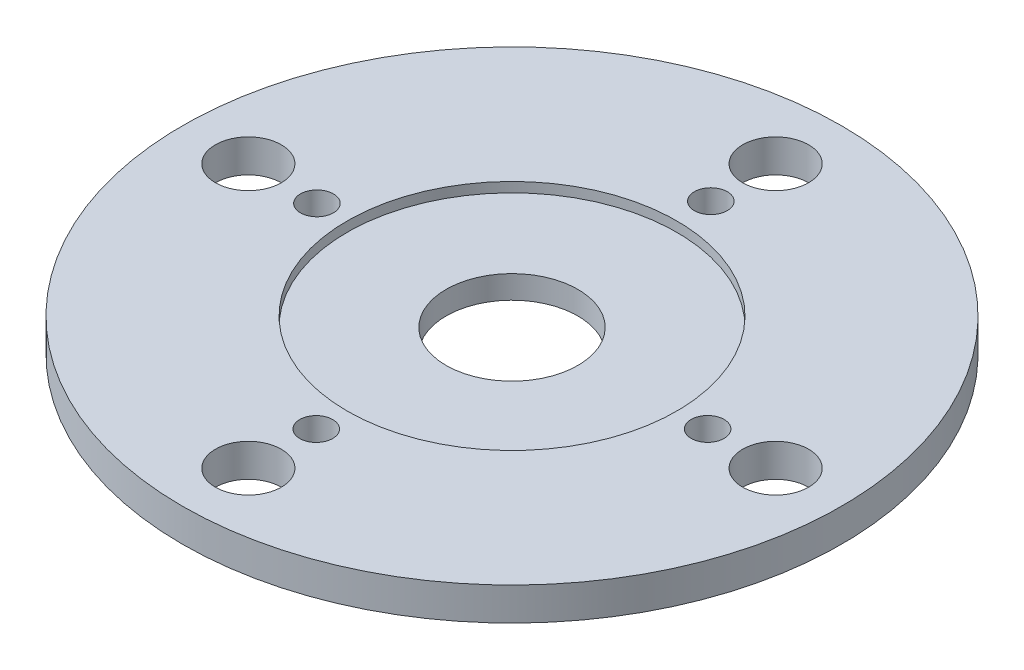
ISO-10303-21;
HEADER;
FILE_DESCRIPTION(('STEP AP214'),'2;1');
FILE_NAME('part.step','',(''),(''),'','','');
FILE_SCHEMA(('AUTOMOTIVE_DESIGN { 1 0 10303 214 1 1 1 1 }'));
ENDSEC;
DATA;
#1=APPLICATION_CONTEXT('core data for automotive mechanical design processes');
#2=APPLICATION_PROTOCOL_DEFINITION('international standard','automotive_design',2000,#1);
#3=PRODUCT_CONTEXT('',#1,'mechanical');
#4=PRODUCT('Part','Part','',(#3));
#5=PRODUCT_RELATED_PRODUCT_CATEGORY('part','',(#4));
#6=PRODUCT_DEFINITION_FORMATION('','',#4);
#7=PRODUCT_DEFINITION_CONTEXT('part definition',#1,'design');
#8=PRODUCT_DEFINITION('design','',#6,#7);
#9=PRODUCT_DEFINITION_SHAPE('','',#8);
#10=(LENGTH_UNIT() NAMED_UNIT(*) SI_UNIT(.MILLI.,.METRE.));
#11=(NAMED_UNIT(*) PLANE_ANGLE_UNIT() SI_UNIT($,.RADIAN.));
#12=(NAMED_UNIT(*) SI_UNIT($,.STERADIAN.) SOLID_ANGLE_UNIT());
#13=UNCERTAINTY_MEASURE_WITH_UNIT(LENGTH_MEASURE(1.E-05),#10,'distance_accuracy_value','');
#14=(GEOMETRIC_REPRESENTATION_CONTEXT(3) GLOBAL_UNCERTAINTY_ASSIGNED_CONTEXT((#13)) GLOBAL_UNIT_ASSIGNED_CONTEXT((#10,
#11,#12)) REPRESENTATION_CONTEXT('',''));
#15=CARTESIAN_POINT('',(0.,0.,0.));
#16=DIRECTION('',(0.,0.,1.));
#17=DIRECTION('',(1.,0.,0.));
#18=AXIS2_PLACEMENT_3D('',#15,#16,#17);
#19=CARTESIAN_POINT('',(0.,1.,0.));
#20=DIRECTION('',(0.,-1.,0.));
#21=DIRECTION('',(0.,0.,-1.));
#22=AXIS2_PLACEMENT_3D('',#19,#20,#21);
#23=CYLINDRICAL_SURFACE('',#22,2.);
#24=CARTESIAN_POINT('',(0.,0.,0.));
#25=DIRECTION('',(0.,1.,0.));
#26=DIRECTION('',(0.,0.,1.));
#27=AXIS2_PLACEMENT_3D('',#24,#25,#26);
#28=CIRCLE('',#27,2.);
#29=CARTESIAN_POINT('',(0.,0.,2.));
#30=VERTEX_POINT('',#29);
#31=EDGE_CURVE('E44',#30,#30,#28,.T.);
#32=ORIENTED_EDGE('',*,*,#31,.F.);
#33=EDGE_LOOP('',(#32));
#34=FACE_BOUND('',#33,.T.);
#35=CARTESIAN_POINT('',(0.,0.7,0.));
#36=DIRECTION('',(0.,1.,0.));
#37=DIRECTION('',(0.,0.,1.));
#38=AXIS2_PLACEMENT_3D('',#35,#36,#37);
#39=CIRCLE('',#38,2.);
#40=CARTESIAN_POINT('',(0.,0.7,2.));
#41=VERTEX_POINT('',#40);
#42=EDGE_CURVE('E35',#41,#41,#39,.T.);
#43=ORIENTED_EDGE('',*,*,#42,.T.);
#44=EDGE_LOOP('',(#43));
#45=FACE_BOUND('',#44,.T.);
#46=ADVANCED_FACE('F31',(#34,#45),#23,.F.);
#47=CARTESIAN_POINT('',(0.,1.,0.));
#48=DIRECTION('',(0.,1.,0.));
#49=DIRECTION('',(0.,0.,1.));
#50=AXIS2_PLACEMENT_3D('',#47,#48,#49);
#51=PLANE('',#50);
#52=CARTESIAN_POINT('',(0.,1.,0.));
#53=DIRECTION('',(0.,1.,0.));
#54=DIRECTION('',(0.,0.,1.));
#55=AXIS2_PLACEMENT_3D('',#52,#53,#54);
#56=CIRCLE('',#55,5.);
#57=CARTESIAN_POINT('',(0.,1.,5.));
#58=VERTEX_POINT('',#57);
#59=EDGE_CURVE('E96',#58,#58,#56,.T.);
#60=ORIENTED_EDGE('',*,*,#59,.F.);
#61=EDGE_LOOP('',(#60));
#62=FACE_BOUND('',#61,.T.);
#63=CARTESIAN_POINT('',(-2.8421709430404E-11,1.,-6.03335240026581));
#64=DIRECTION('',(0.,1.,0.));
#65=DIRECTION('',(0.,0.,1.));
#66=AXIS2_PLACEMENT_3D('',#63,#64,#65);
#67=CIRCLE('',#66,0.499999999999999);
#68=CARTESIAN_POINT('',(-2.8421709430404E-11,1.,-5.53335240026581));
#69=VERTEX_POINT('',#68);
#70=EDGE_CURVE('E82',#69,#69,#67,.T.);
#71=ORIENTED_EDGE('',*,*,#70,.F.);
#72=EDGE_LOOP('',(#71));
#73=FACE_BOUND('',#72,.T.);
#74=CARTESIAN_POINT('',(5.93682324591782,1.,-2.8421709430404E-11));
#75=DIRECTION('',(0.,1.,0.));
#76=DIRECTION('',(0.,0.,-1.));
#77=AXIS2_PLACEMENT_3D('',#74,#75,#76);
#78=CIRCLE('',#77,0.5);
#79=CARTESIAN_POINT('',(5.93682324591782,1.,-0.500000000028421));
#80=VERTEX_POINT('',#79);
#81=EDGE_CURVE('E70',#80,#80,#78,.T.);
#82=ORIENTED_EDGE('',*,*,#81,.F.);
#83=EDGE_LOOP('',(#82));
#84=FACE_BOUND('',#83,.T.);
#85=CARTESIAN_POINT('',(0.,1.,5.94141571224327));
#86=DIRECTION('',(0.,1.,0.));
#87=DIRECTION('',(0.,0.,-1.));
#88=AXIS2_PLACEMENT_3D('',#85,#86,#87);
#89=CIRCLE('',#88,0.500000000000001);
#90=CARTESIAN_POINT('',(0.,1.,5.44141571224327));
#91=VERTEX_POINT('',#90);
#92=EDGE_CURVE('E58',#91,#91,#89,.T.);
#93=ORIENTED_EDGE('',*,*,#92,.F.);
#94=EDGE_LOOP('',(#93));
#95=FACE_BOUND('',#94,.T.);
#96=CARTESIAN_POINT('',(-8.,1.,0.));
#97=DIRECTION('',(0.,1.,0.));
#98=DIRECTION('',(0.,0.,1.));
#99=AXIS2_PLACEMENT_3D('',#96,#97,#98);
#100=CIRCLE('',#99,1.);
#101=CARTESIAN_POINT('',(-8.,1.,1.));
#102=VERTEX_POINT('',#101);
#103=EDGE_CURVE('E48',#102,#102,#100,.T.);
#104=ORIENTED_EDGE('',*,*,#103,.F.);
#105=EDGE_LOOP('',(#104));
#106=FACE_BOUND('',#105,.T.);
#107=CARTESIAN_POINT('',(0.,1.,0.));
#108=DIRECTION('',(0.,1.,0.));
#109=DIRECTION('',(0.,0.,1.));
#110=AXIS2_PLACEMENT_3D('',#107,#108,#109);
#111=CIRCLE('',#110,10.);
#112=CARTESIAN_POINT('',(0.,1.,10.));
#113=VERTEX_POINT('',#112);
#114=EDGE_CURVE('E10',#113,#113,#111,.T.);
#115=ORIENTED_EDGE('',*,*,#114,.T.);
#116=EDGE_LOOP('',(#115));
#117=FACE_BOUND('',#116,.T.);
#118=CARTESIAN_POINT('',(-5.91917261272101,1.,0.));
#119=DIRECTION('',(0.,1.,0.));
#120=DIRECTION('',(0.,0.,1.));
#121=AXIS2_PLACEMENT_3D('',#118,#119,#120);
#122=CIRCLE('',#121,0.5);
#123=CARTESIAN_POINT('',(-5.91917261272101,1.,0.5));
#124=VERTEX_POINT('',#123);
#125=EDGE_CURVE('E52',#124,#124,#122,.T.);
#126=ORIENTED_EDGE('',*,*,#125,.F.);
#127=EDGE_LOOP('',(#126));
#128=FACE_BOUND('',#127,.T.);
#129=CARTESIAN_POINT('',(0.,1.,8.));
#130=DIRECTION('',(0.,1.,0.));
#131=DIRECTION('',(0.,0.,-1.));
#132=AXIS2_PLACEMENT_3D('',#129,#130,#131);
#133=CIRCLE('',#132,1.);
#134=CARTESIAN_POINT('',(0.,1.,7.));
#135=VERTEX_POINT('',#134);
#136=EDGE_CURVE('E64',#135,#135,#133,.T.);
#137=ORIENTED_EDGE('',*,*,#136,.F.);
#138=EDGE_LOOP('',(#137));
#139=FACE_BOUND('',#138,.T.);
#140=CARTESIAN_POINT('',(8.,1.,0.));
#141=DIRECTION('',(0.,1.,0.));
#142=DIRECTION('',(0.,0.,-1.));
#143=AXIS2_PLACEMENT_3D('',#140,#141,#142);
#144=CIRCLE('',#143,1.);
#145=CARTESIAN_POINT('',(8.,1.,-1.));
#146=VERTEX_POINT('',#145);
#147=EDGE_CURVE('E76',#146,#146,#144,.T.);
#148=ORIENTED_EDGE('',*,*,#147,.F.);
#149=EDGE_LOOP('',(#148));
#150=FACE_BOUND('',#149,.T.);
#151=CARTESIAN_POINT('',(0.,1.,-8.));
#152=DIRECTION('',(0.,1.,0.));
#153=DIRECTION('',(0.,0.,1.));
#154=AXIS2_PLACEMENT_3D('',#151,#152,#153);
#155=CIRCLE('',#154,1.);
#156=CARTESIAN_POINT('',(0.,1.,-7.));
#157=VERTEX_POINT('',#156);
#158=EDGE_CURVE('E88',#157,#157,#155,.T.);
#159=ORIENTED_EDGE('',*,*,#158,.F.);
#160=EDGE_LOOP('',(#159));
#161=FACE_BOUND('',#160,.T.);
#162=ADVANCED_FACE('F118',(#62,#73,#84,#95,#106,#117,#128,#139,#150,#161),#51,.T.);
#163=CARTESIAN_POINT('',(0.,0.,0.));
#164=DIRECTION('',(0.,1.,0.));
#165=DIRECTION('',(0.,0.,1.));
#166=AXIS2_PLACEMENT_3D('',#163,#164,#165);
#167=PLANE('',#166);
#168=CARTESIAN_POINT('',(0.,0.,0.));
#169=DIRECTION('',(0.,1.,0.));
#170=DIRECTION('',(0.,0.,1.));
#171=AXIS2_PLACEMENT_3D('',#168,#169,#170);
#172=CIRCLE('',#171,10.);
#173=CARTESIAN_POINT('',(0.,0.,10.));
#174=VERTEX_POINT('',#173);
#175=EDGE_CURVE('E39',#174,#174,#172,.T.);
#176=ORIENTED_EDGE('',*,*,#175,.F.);
#177=EDGE_LOOP('',(#176));
#178=FACE_BOUND('',#177,.T.);
#179=ORIENTED_EDGE('',*,*,#31,.T.);
#180=EDGE_LOOP('',(#179));
#181=FACE_BOUND('',#180,.T.);
#182=CARTESIAN_POINT('',(-8.,0.,0.));
#183=DIRECTION('',(0.,1.,0.));
#184=DIRECTION('',(0.,0.,1.));
#185=AXIS2_PLACEMENT_3D('',#182,#183,#184);
#186=CIRCLE('',#185,1.);
#187=CARTESIAN_POINT('',(-8.,0.,1.));
#188=VERTEX_POINT('',#187);
#189=EDGE_CURVE('E49',#188,#188,#186,.T.);
#190=ORIENTED_EDGE('',*,*,#189,.T.);
#191=EDGE_LOOP('',(#190));
#192=FACE_BOUND('',#191,.T.);
#193=CARTESIAN_POINT('',(-5.91917261272101,0.,0.));
#194=DIRECTION('',(0.,1.,0.));
#195=DIRECTION('',(0.,0.,1.));
#196=AXIS2_PLACEMENT_3D('',#193,#194,#195);
#197=CIRCLE('',#196,0.5);
#198=CARTESIAN_POINT('',(-5.91917261272101,0.,0.5));
#199=VERTEX_POINT('',#198);
#200=EDGE_CURVE('E55',#199,#199,#197,.T.);
#201=ORIENTED_EDGE('',*,*,#200,.T.);
#202=EDGE_LOOP('',(#201));
#203=FACE_BOUND('',#202,.T.);
#204=CARTESIAN_POINT('',(0.,0.,5.94141571224327));
#205=DIRECTION('',(0.,1.,0.));
#206=DIRECTION('',(0.,0.,-1.));
#207=AXIS2_PLACEMENT_3D('',#204,#205,#206);
#208=CIRCLE('',#207,0.500000000000001);
#209=CARTESIAN_POINT('',(0.,0.,5.44141571224327));
#210=VERTEX_POINT('',#209);
#211=EDGE_CURVE('E61',#210,#210,#208,.T.);
#212=ORIENTED_EDGE('',*,*,#211,.T.);
#213=EDGE_LOOP('',(#212));
#214=FACE_BOUND('',#213,.T.);
#215=CARTESIAN_POINT('',(0.,0.,8.));
#216=DIRECTION('',(0.,1.,0.));
#217=DIRECTION('',(0.,0.,-1.));
#218=AXIS2_PLACEMENT_3D('',#215,#216,#217);
#219=CIRCLE('',#218,1.);
#220=CARTESIAN_POINT('',(0.,0.,7.));
#221=VERTEX_POINT('',#220);
#222=EDGE_CURVE('E67',#221,#221,#219,.T.);
#223=ORIENTED_EDGE('',*,*,#222,.T.);
#224=EDGE_LOOP('',(#223));
#225=FACE_BOUND('',#224,.T.);
#226=CARTESIAN_POINT('',(5.93682324591782,0.,-2.8421709430404E-11));
#227=DIRECTION('',(0.,1.,0.));
#228=DIRECTION('',(0.,0.,-1.));
#229=AXIS2_PLACEMENT_3D('',#226,#227,#228);
#230=CIRCLE('',#229,0.5);
#231=CARTESIAN_POINT('',(5.93682324591782,0.,-0.500000000028421));
#232=VERTEX_POINT('',#231);
#233=EDGE_CURVE('E73',#232,#232,#230,.T.);
#234=ORIENTED_EDGE('',*,*,#233,.T.);
#235=EDGE_LOOP('',(#234));
#236=FACE_BOUND('',#235,.T.);
#237=CARTESIAN_POINT('',(8.,0.,0.));
#238=DIRECTION('',(0.,1.,0.));
#239=DIRECTION('',(0.,0.,-1.));
#240=AXIS2_PLACEMENT_3D('',#237,#238,#239);
#241=CIRCLE('',#240,1.);
#242=CARTESIAN_POINT('',(8.,0.,-1.));
#243=VERTEX_POINT('',#242);
#244=EDGE_CURVE('E79',#243,#243,#241,.T.);
#245=ORIENTED_EDGE('',*,*,#244,.T.);
#246=EDGE_LOOP('',(#245));
#247=FACE_BOUND('',#246,.T.);
#248=CARTESIAN_POINT('',(-2.8421709430404E-11,0.,-6.03335240026581));
#249=DIRECTION('',(0.,1.,0.));
#250=DIRECTION('',(0.,0.,1.));
#251=AXIS2_PLACEMENT_3D('',#248,#249,#250);
#252=CIRCLE('',#251,0.499999999999999);
#253=CARTESIAN_POINT('',(-2.8421709430404E-11,0.,-5.53335240026581));
#254=VERTEX_POINT('',#253);
#255=EDGE_CURVE('E85',#254,#254,#252,.T.);
#256=ORIENTED_EDGE('',*,*,#255,.T.);
#257=EDGE_LOOP('',(#256));
#258=FACE_BOUND('',#257,.T.);
#259=CARTESIAN_POINT('',(0.,0.,-8.));
#260=DIRECTION('',(0.,1.,0.));
#261=DIRECTION('',(0.,0.,1.));
#262=AXIS2_PLACEMENT_3D('',#259,#260,#261);
#263=CIRCLE('',#262,1.);
#264=CARTESIAN_POINT('',(0.,0.,-7.));
#265=VERTEX_POINT('',#264);
#266=EDGE_CURVE('E91',#265,#265,#263,.T.);
#267=ORIENTED_EDGE('',*,*,#266,.T.);
#268=EDGE_LOOP('',(#267));
#269=FACE_BOUND('',#268,.T.);
#270=ADVANCED_FACE('F124',(#178,#181,#192,#203,#214,#225,#236,#247,#258,#269),#167,.F.);
#271=CARTESIAN_POINT('',(0.,1.,0.));
#272=DIRECTION('',(0.,-1.,0.));
#273=DIRECTION('',(0.,0.,-1.));
#274=AXIS2_PLACEMENT_3D('',#271,#272,#273);
#275=CYLINDRICAL_SURFACE('',#274,10.);
#276=ORIENTED_EDGE('',*,*,#114,.F.);
#277=EDGE_LOOP('',(#276));
#278=FACE_BOUND('',#277,.T.);
#279=ORIENTED_EDGE('',*,*,#175,.T.);
#280=EDGE_LOOP('',(#279));
#281=FACE_BOUND('',#280,.T.);
#282=ADVANCED_FACE('F33',(#278,#281),#275,.T.);
#283=CARTESIAN_POINT('',(-8.,1.,0.));
#284=DIRECTION('',(0.,-1.,0.));
#285=DIRECTION('',(0.,0.,-1.));
#286=AXIS2_PLACEMENT_3D('',#283,#284,#285);
#287=CYLINDRICAL_SURFACE('',#286,1.);
#288=ORIENTED_EDGE('',*,*,#103,.T.);
#289=EDGE_LOOP('',(#288));
#290=FACE_BOUND('',#289,.T.);
#291=ORIENTED_EDGE('',*,*,#189,.F.);
#292=EDGE_LOOP('',(#291));
#293=FACE_BOUND('',#292,.T.);
#294=ADVANCED_FACE('F129',(#290,#293),#287,.F.);
#295=CARTESIAN_POINT('',(-5.91917261272101,1.,0.));
#296=DIRECTION('',(0.,-1.,0.));
#297=DIRECTION('',(0.,0.,-1.));
#298=AXIS2_PLACEMENT_3D('',#295,#296,#297);
#299=CYLINDRICAL_SURFACE('',#298,0.5);
#300=ORIENTED_EDGE('',*,*,#125,.T.);
#301=EDGE_LOOP('',(#300));
#302=FACE_BOUND('',#301,.T.);
#303=ORIENTED_EDGE('',*,*,#200,.F.);
#304=EDGE_LOOP('',(#303));
#305=FACE_BOUND('',#304,.T.);
#306=ADVANCED_FACE('F180',(#302,#305),#299,.F.);
#307=CARTESIAN_POINT('',(0.,1.,5.94141571224327));
#308=DIRECTION('',(0.,-1.,0.));
#309=DIRECTION('',(0.,0.,-1.));
#310=AXIS2_PLACEMENT_3D('',#307,#308,#309);
#311=CYLINDRICAL_SURFACE('',#310,0.500000000000001);
#312=ORIENTED_EDGE('',*,*,#92,.T.);
#313=EDGE_LOOP('',(#312));
#314=FACE_BOUND('',#313,.T.);
#315=ORIENTED_EDGE('',*,*,#211,.F.);
#316=EDGE_LOOP('',(#315));
#317=FACE_BOUND('',#316,.T.);
#318=ADVANCED_FACE('F177',(#314,#317),#311,.F.);
#319=CARTESIAN_POINT('',(0.,1.,8.));
#320=DIRECTION('',(0.,-1.,0.));
#321=DIRECTION('',(0.,0.,-1.));
#322=AXIS2_PLACEMENT_3D('',#319,#320,#321);
#323=CYLINDRICAL_SURFACE('',#322,1.);
#324=ORIENTED_EDGE('',*,*,#136,.T.);
#325=EDGE_LOOP('',(#324));
#326=FACE_BOUND('',#325,.T.);
#327=ORIENTED_EDGE('',*,*,#222,.F.);
#328=EDGE_LOOP('',(#327));
#329=FACE_BOUND('',#328,.T.);
#330=ADVANCED_FACE('F173',(#326,#329),#323,.F.);
#331=CARTESIAN_POINT('',(5.93682324591782,1.,-2.8421709430404E-11));
#332=DIRECTION('',(0.,-1.,0.));
#333=DIRECTION('',(0.,0.,-1.));
#334=AXIS2_PLACEMENT_3D('',#331,#332,#333);
#335=CYLINDRICAL_SURFACE('',#334,0.5);
#336=ORIENTED_EDGE('',*,*,#81,.T.);
#337=EDGE_LOOP('',(#336));
#338=FACE_BOUND('',#337,.T.);
#339=ORIENTED_EDGE('',*,*,#233,.F.);
#340=EDGE_LOOP('',(#339));
#341=FACE_BOUND('',#340,.T.);
#342=ADVANCED_FACE('F169',(#338,#341),#335,.F.);
#343=CARTESIAN_POINT('',(8.,1.,0.));
#344=DIRECTION('',(0.,-1.,0.));
#345=DIRECTION('',(0.,0.,-1.));
#346=AXIS2_PLACEMENT_3D('',#343,#344,#345);
#347=CYLINDRICAL_SURFACE('',#346,1.);
#348=ORIENTED_EDGE('',*,*,#147,.T.);
#349=EDGE_LOOP('',(#348));
#350=FACE_BOUND('',#349,.T.);
#351=ORIENTED_EDGE('',*,*,#244,.F.);
#352=EDGE_LOOP('',(#351));
#353=FACE_BOUND('',#352,.T.);
#354=ADVANCED_FACE('F163',(#350,#353),#347,.F.);
#355=CARTESIAN_POINT('',(-2.8421709430404E-11,1.,-6.03335240026581));
#356=DIRECTION('',(0.,-1.,0.));
#357=DIRECTION('',(0.,0.,-1.));
#358=AXIS2_PLACEMENT_3D('',#355,#356,#357);
#359=CYLINDRICAL_SURFACE('',#358,0.499999999999999);
#360=ORIENTED_EDGE('',*,*,#70,.T.);
#361=EDGE_LOOP('',(#360));
#362=FACE_BOUND('',#361,.T.);
#363=ORIENTED_EDGE('',*,*,#255,.F.);
#364=EDGE_LOOP('',(#363));
#365=FACE_BOUND('',#364,.T.);
#366=ADVANCED_FACE('F157',(#362,#365),#359,.F.);
#367=CARTESIAN_POINT('',(0.,1.,-8.));
#368=DIRECTION('',(0.,-1.,0.));
#369=DIRECTION('',(0.,0.,-1.));
#370=AXIS2_PLACEMENT_3D('',#367,#368,#369);
#371=CYLINDRICAL_SURFACE('',#370,1.);
#372=ORIENTED_EDGE('',*,*,#158,.T.);
#373=EDGE_LOOP('',(#372));
#374=FACE_BOUND('',#373,.T.);
#375=ORIENTED_EDGE('',*,*,#266,.F.);
#376=EDGE_LOOP('',(#375));
#377=FACE_BOUND('',#376,.T.);
#378=ADVANCED_FACE('F114',(#374,#377),#371,.F.);
#379=CARTESIAN_POINT('',(0.,0.7,0.));
#380=DIRECTION('',(0.,1.,0.));
#381=DIRECTION('',(0.,0.,1.));
#382=AXIS2_PLACEMENT_3D('',#379,#380,#381);
#383=CYLINDRICAL_SURFACE('',#382,5.);
#384=CARTESIAN_POINT('',(0.,0.7,0.));
#385=DIRECTION('',(0.,1.,0.));
#386=DIRECTION('',(0.,0.,1.));
#387=AXIS2_PLACEMENT_3D('',#384,#385,#386);
#388=CIRCLE('',#387,5.);
#389=CARTESIAN_POINT('',(0.,0.7,5.));
#390=VERTEX_POINT('',#389);
#391=EDGE_CURVE('E99',#390,#390,#388,.T.);
#392=ORIENTED_EDGE('',*,*,#391,.F.);
#393=EDGE_LOOP('',(#392));
#394=FACE_BOUND('',#393,.T.);
#395=ORIENTED_EDGE('',*,*,#59,.T.);
#396=EDGE_LOOP('',(#395));
#397=FACE_BOUND('',#396,.T.);
#398=ADVANCED_FACE('F109',(#394,#397),#383,.F.);
#399=CARTESIAN_POINT('',(0.,0.7,0.));
#400=DIRECTION('',(0.,1.,0.));
#401=DIRECTION('',(0.,0.,1.));
#402=AXIS2_PLACEMENT_3D('',#399,#400,#401);
#403=PLANE('',#402);
#404=ORIENTED_EDGE('',*,*,#42,.F.);
#405=EDGE_LOOP('',(#404));
#406=FACE_BOUND('',#405,.T.);
#407=ORIENTED_EDGE('',*,*,#391,.T.);
#408=EDGE_LOOP('',(#407));
#409=FACE_BOUND('',#408,.T.);
#410=ADVANCED_FACE('F107',(#406,#409),#403,.T.);
#411=CLOSED_SHELL('',(#46,#162,#270,#282,#294,#306,#318,#330,#342,#354,#366,#378,#398,#410));
#412=MANIFOLD_SOLID_BREP('B2',#411);
#413=ADVANCED_BREP_SHAPE_REPRESENTATION('',(#18,#412),#14);
#414=SHAPE_DEFINITION_REPRESENTATION(#9,#413);
ENDSEC;
END-ISO-10303-21;
